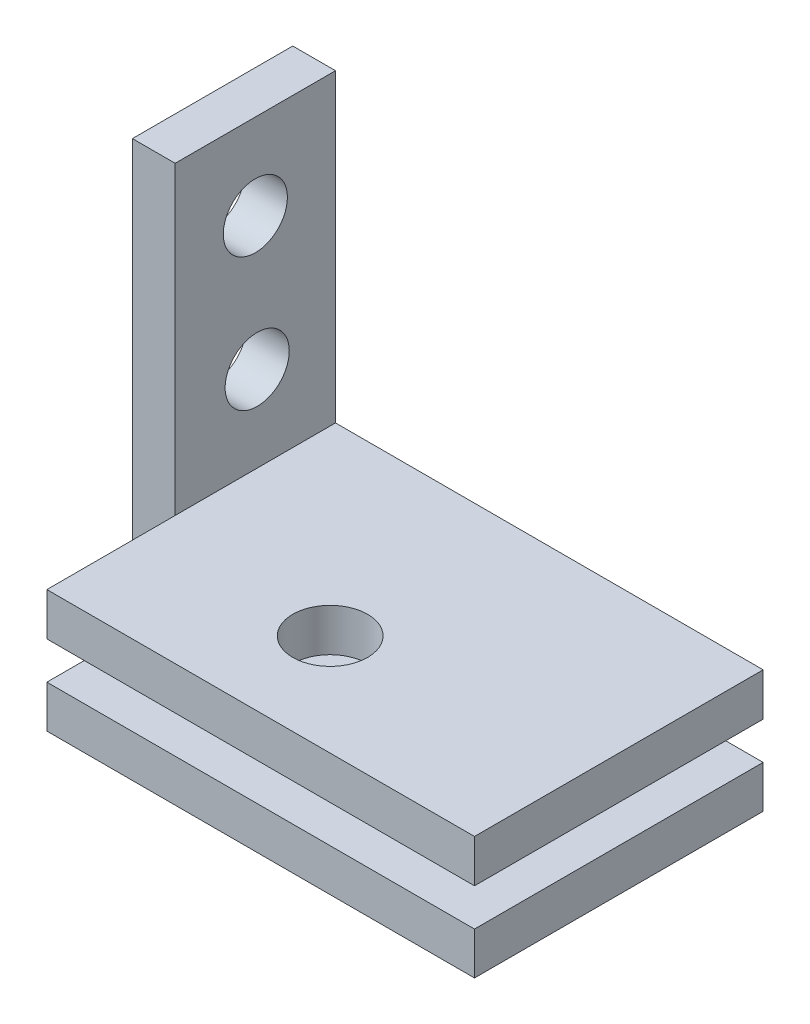
ISO-10303-21;
HEADER;
FILE_DESCRIPTION(('STEP AP214'),'2;1');
FILE_NAME('part.step','',(''),(''),'','','');
FILE_SCHEMA(('AUTOMOTIVE_DESIGN { 1 0 10303 214 1 1 1 1 }'));
ENDSEC;
DATA;
#1=APPLICATION_CONTEXT('core data for automotive mechanical design processes');
#2=APPLICATION_PROTOCOL_DEFINITION('international standard','automotive_design',2000,#1);
#3=PRODUCT_CONTEXT('',#1,'mechanical');
#4=PRODUCT('Part','Part','',(#3));
#5=PRODUCT_RELATED_PRODUCT_CATEGORY('part','',(#4));
#6=PRODUCT_DEFINITION_FORMATION('','',#4);
#7=PRODUCT_DEFINITION_CONTEXT('part definition',#1,'design');
#8=PRODUCT_DEFINITION('design','',#6,#7);
#9=PRODUCT_DEFINITION_SHAPE('','',#8);
#10=(LENGTH_UNIT() NAMED_UNIT(*) SI_UNIT(.MILLI.,.METRE.));
#11=(NAMED_UNIT(*) PLANE_ANGLE_UNIT() SI_UNIT($,.RADIAN.));
#12=(NAMED_UNIT(*) SI_UNIT($,.STERADIAN.) SOLID_ANGLE_UNIT());
#13=UNCERTAINTY_MEASURE_WITH_UNIT(LENGTH_MEASURE(1.E-05),#10,'distance_accuracy_value','');
#14=(GEOMETRIC_REPRESENTATION_CONTEXT(3) GLOBAL_UNCERTAINTY_ASSIGNED_CONTEXT((#13)) GLOBAL_UNIT_ASSIGNED_CONTEXT((#10,
#11,#12)) REPRESENTATION_CONTEXT('',''));
#15=CARTESIAN_POINT('',(0.,0.,0.));
#16=DIRECTION('',(0.,0.,1.));
#17=DIRECTION('',(1.,0.,0.));
#18=AXIS2_PLACEMENT_3D('',#15,#16,#17);
#19=CARTESIAN_POINT('',(2.,9.02439024390244,0.740418118466899));
#20=DIRECTION('',(0.,0.,-1.));
#21=DIRECTION('',(0.,1.,0.));
#22=AXIS2_PLACEMENT_3D('',#19,#20,#21);
#23=PLANE('',#22);
#24=DIRECTION('',(0.,-1.,0.));
#25=VECTOR('',#24,1.);
#26=CARTESIAN_POINT('',(2.,-8.99213043612717,0.740418118466898));
#27=LINE('',#26,#25);
#28=CARTESIAN_POINT('',(2.,-8.99213043612717,0.740418118466898));
#29=VERTEX_POINT('',#28);
#30=CARTESIAN_POINT('',(2.,-10.9756097560976,0.740418118466898));
#31=VERTEX_POINT('',#30);
#32=EDGE_CURVE('E161',#29,#31,#27,.T.);
#33=ORIENTED_EDGE('',*,*,#32,.F.);
#34=DIRECTION('',(0.,-1.,0.));
#35=VECTOR('',#34,1.);
#36=CARTESIAN_POINT('',(2.,9.02439024390244,0.740418118466899));
#37=LINE('',#36,#35);
#38=CARTESIAN_POINT('',(2.,-7.24213043612717,0.740418118466898));
#39=VERTEX_POINT('',#38);
#40=EDGE_CURVE('E255',#39,#29,#37,.T.);
#41=ORIENTED_EDGE('',*,*,#40,.F.);
#42=DIRECTION('',(0.,-1.,0.));
#43=VECTOR('',#42,1.);
#44=CARTESIAN_POINT('',(2.,-5.24213043612717,0.740418118466898));
#45=LINE('',#44,#43);
#46=CARTESIAN_POINT('',(2.,-5.24213043612717,0.740418118466897));
#47=VERTEX_POINT('',#46);
#48=EDGE_CURVE('E62',#47,#39,#45,.T.);
#49=ORIENTED_EDGE('',*,*,#48,.F.);
#50=CARTESIAN_POINT('',(2.,9.02439024390244,0.740418118466899));
#51=VERTEX_POINT('',#50);
#52=EDGE_CURVE('E251',#51,#47,#37,.T.);
#53=ORIENTED_EDGE('',*,*,#52,.F.);
#54=DIRECTION('',(-1.,0.,0.));
#55=VECTOR('',#54,1.);
#56=CARTESIAN_POINT('',(2.,9.02439024390244,0.740418118466899));
#57=LINE('',#56,#55);
#58=CARTESIAN_POINT('',(0.,9.02439024390244,0.740418118466899));
#59=VERTEX_POINT('',#58);
#60=EDGE_CURVE('E261',#51,#59,#57,.T.);
#61=ORIENTED_EDGE('',*,*,#60,.T.);
#62=DIRECTION('',(0.,-1.,0.));
#63=VECTOR('',#62,1.);
#64=CARTESIAN_POINT('',(0.,9.02439024390244,0.740418118466899));
#65=LINE('',#64,#63);
#66=CARTESIAN_POINT('',(0.,-10.9756097560976,0.740418118466897));
#67=VERTEX_POINT('',#66);
#68=EDGE_CURVE('E250',#59,#67,#65,.T.);
#69=ORIENTED_EDGE('',*,*,#68,.T.);
#70=DIRECTION('',(-1.,0.,0.));
#71=VECTOR('',#70,1.);
#72=CARTESIAN_POINT('',(2.,-10.9756097560976,0.740418118466897));
#73=LINE('',#72,#71);
#74=EDGE_CURVE('E11',#31,#67,#73,.T.);
#75=ORIENTED_EDGE('',*,*,#74,.F.);
#76=EDGE_LOOP('',(#33,#41,#49,#53,#61,#69,#75));
#77=FACE_BOUND('',#76,.T.);
#78=ADVANCED_FACE('F45',(#77),#23,.F.);
#79=CARTESIAN_POINT('',(2.,0.,0.));
#80=DIRECTION('',(1.,0.,0.));
#81=DIRECTION('',(0.,0.,-1.));
#82=AXIS2_PLACEMENT_3D('',#79,#80,#81);
#83=PLANE('',#82);
#84=DIRECTION('',(0.,1.,0.));
#85=VECTOR('',#84,1.);
#86=CARTESIAN_POINT('',(2.,9.02439024390244,-6.7595818815331));
#87=LINE('',#86,#85);
#88=CARTESIAN_POINT('',(2.,-8.99213043612717,-6.7595818815331));
#89=VERTEX_POINT('',#88);
#90=CARTESIAN_POINT('',(2.,-7.24213043612718,-6.7595818815331));
#91=VERTEX_POINT('',#90);
#92=EDGE_CURVE('E70',#89,#91,#87,.T.);
#93=ORIENTED_EDGE('',*,*,#92,.T.);
#94=DIRECTION('',(0.,0.,-1.));
#95=VECTOR('',#94,1.);
#96=CARTESIAN_POINT('',(2.,-7.24213043612717,0.));
#97=LINE('',#96,#95);
#98=EDGE_CURVE('E212',#39,#91,#97,.T.);
#99=ORIENTED_EDGE('',*,*,#98,.F.);
#100=ORIENTED_EDGE('',*,*,#40,.T.);
#101=DIRECTION('',(0.,0.,1.));
#102=VECTOR('',#101,1.);
#103=CARTESIAN_POINT('',(2.,-8.99213043612717,-6.7595818815331));
#104=LINE('',#103,#102);
#105=EDGE_CURVE('E233',#89,#29,#104,.T.);
#106=ORIENTED_EDGE('',*,*,#105,.F.);
#107=EDGE_LOOP('',(#93,#99,#100,#106));
#108=FACE_BOUND('',#107,.T.);
#109=ADVANCED_FACE('F310',(#108),#83,.T.);
#110=CARTESIAN_POINT('',(2.,-10.9756097560976,0.740418118466897));
#111=DIRECTION('',(0.,1.,0.));
#112=DIRECTION('',(0.,0.,1.));
#113=AXIS2_PLACEMENT_3D('',#110,#111,#112);
#114=PLANE('',#113);
#115=CARTESIAN_POINT('',(10.5,-10.9756097560976,1.9904181184669));
#116=DIRECTION('',(0.,1.,0.));
#117=DIRECTION('',(0.,0.,1.));
#118=AXIS2_PLACEMENT_3D('',#115,#116,#117);
#119=CIRCLE('',#118,1.75);
#120=CARTESIAN_POINT('',(10.5,-10.9756097560976,3.7404181184669));
#121=VERTEX_POINT('',#120);
#122=EDGE_CURVE('E318',#121,#121,#119,.T.);
#123=ORIENTED_EDGE('',*,*,#122,.T.);
#124=EDGE_LOOP('',(#123));
#125=FACE_BOUND('',#124,.T.);
#126=DIRECTION('',(0.,0.,-1.));
#127=VECTOR('',#126,1.);
#128=CARTESIAN_POINT('',(0.,-10.9756097560976,0.740418118466897));
#129=LINE('',#128,#127);
#130=CARTESIAN_POINT('',(0.,-10.9756097560976,-6.7595818815331));
#131=VERTEX_POINT('',#130);
#132=EDGE_CURVE('E265',#67,#131,#129,.T.);
#133=ORIENTED_EDGE('',*,*,#132,.T.);
#134=DIRECTION('',(-1.,0.,0.));
#135=VECTOR('',#134,1.);
#136=CARTESIAN_POINT('',(2.,-10.9756097560976,-6.7595818815331));
#137=LINE('',#136,#135);
#138=CARTESIAN_POINT('',(22.,-10.9756097560976,-6.7595818815331));
#139=VERTEX_POINT('',#138);
#140=EDGE_CURVE('E54',#139,#131,#137,.T.);
#141=ORIENTED_EDGE('',*,*,#140,.F.);
#142=DIRECTION('',(0.,0.,-1.));
#143=VECTOR('',#142,1.);
#144=CARTESIAN_POINT('',(22.,-10.9756097560976,-6.7595818815331));
#145=LINE('',#144,#143);
#146=CARTESIAN_POINT('',(22.,-10.9756097560976,6.7404181184669));
#147=VERTEX_POINT('',#146);
#148=EDGE_CURVE('E146',#147,#139,#145,.T.);
#149=ORIENTED_EDGE('',*,*,#148,.F.);
#150=DIRECTION('',(1.,0.,0.));
#151=VECTOR('',#150,1.);
#152=CARTESIAN_POINT('',(2.,-10.9756097560976,6.7404181184669));
#153=LINE('',#152,#151);
#154=CARTESIAN_POINT('',(2.,-10.9756097560976,6.7404181184669));
#155=VERTEX_POINT('',#154);
#156=EDGE_CURVE('E139',#155,#147,#153,.T.);
#157=ORIENTED_EDGE('',*,*,#156,.F.);
#158=DIRECTION('',(0.,0.,-1.));
#159=VECTOR('',#158,1.);
#160=CARTESIAN_POINT('',(2.,-10.9756097560976,6.7404181184669));
#161=LINE('',#160,#159);
#162=EDGE_CURVE('E143',#155,#31,#161,.T.);
#163=ORIENTED_EDGE('',*,*,#162,.T.);
#164=ORIENTED_EDGE('',*,*,#74,.T.);
#165=EDGE_LOOP('',(#133,#141,#149,#157,#163,#164));
#166=FACE_BOUND('',#165,.T.);
#167=ADVANCED_FACE('F141',(#125,#166),#114,.F.);
#168=CARTESIAN_POINT('',(2.,9.02439024390244,-6.7595818815331));
#169=DIRECTION('',(0.,0.,1.));
#170=DIRECTION('',(1.,0.,0.));
#171=AXIS2_PLACEMENT_3D('',#168,#169,#170);
#172=PLANE('',#171);
#173=DIRECTION('',(0.,1.,0.));
#174=VECTOR('',#173,1.);
#175=CARTESIAN_POINT('',(0.,9.02439024390244,-6.7595818815331));
#176=LINE('',#175,#174);
#177=CARTESIAN_POINT('',(0.,9.02439024390244,-6.7595818815331));
#178=VERTEX_POINT('',#177);
#179=EDGE_CURVE('E268',#131,#178,#176,.T.);
#180=ORIENTED_EDGE('',*,*,#179,.T.);
#181=DIRECTION('',(-1.,0.,0.));
#182=VECTOR('',#181,1.);
#183=CARTESIAN_POINT('',(2.,9.02439024390244,-6.7595818815331));
#184=LINE('',#183,#182);
#185=CARTESIAN_POINT('',(2.,9.02439024390244,-6.7595818815331));
#186=VERTEX_POINT('',#185);
#187=EDGE_CURVE('E277',#186,#178,#184,.T.);
#188=ORIENTED_EDGE('',*,*,#187,.F.);
#189=CARTESIAN_POINT('',(2.,-5.24213043612717,-6.7595818815331));
#190=VERTEX_POINT('',#189);
#191=EDGE_CURVE('E254',#190,#186,#87,.T.);
#192=ORIENTED_EDGE('',*,*,#191,.F.);
#193=DIRECTION('',(-1.,0.,0.));
#194=VECTOR('',#193,1.);
#195=CARTESIAN_POINT('',(22.,-5.24213043612717,-6.7595818815331));
#196=LINE('',#195,#194);
#197=CARTESIAN_POINT('',(22.,-5.24213043612717,-6.7595818815331));
#198=VERTEX_POINT('',#197);
#199=EDGE_CURVE('E218',#198,#190,#196,.T.);
#200=ORIENTED_EDGE('',*,*,#199,.F.);
#201=DIRECTION('',(0.,1.,0.));
#202=VECTOR('',#201,1.);
#203=CARTESIAN_POINT('',(22.,0.,-6.7595818815331));
#204=LINE('',#203,#202);
#205=CARTESIAN_POINT('',(22.,-7.24213043612717,-6.7595818815331));
#206=VERTEX_POINT('',#205);
#207=EDGE_CURVE('E215',#206,#198,#204,.T.);
#208=ORIENTED_EDGE('',*,*,#207,.F.);
#209=DIRECTION('',(-1.,0.,0.));
#210=VECTOR('',#209,1.);
#211=CARTESIAN_POINT('',(22.,-7.24213043612717,-6.7595818815331));
#212=LINE('',#211,#210);
#213=EDGE_CURVE('E229',#206,#91,#212,.T.);
#214=ORIENTED_EDGE('',*,*,#213,.T.);
#215=ORIENTED_EDGE('',*,*,#92,.F.);
#216=DIRECTION('',(-1.,0.,0.));
#217=VECTOR('',#216,1.);
#218=CARTESIAN_POINT('',(22.,-8.99213043612717,-6.7595818815331));
#219=LINE('',#218,#217);
#220=CARTESIAN_POINT('',(22.,-8.99213043612717,-6.7595818815331));
#221=VERTEX_POINT('',#220);
#222=EDGE_CURVE('E243',#221,#89,#219,.T.);
#223=ORIENTED_EDGE('',*,*,#222,.F.);
#224=DIRECTION('',(0.,1.,0.));
#225=VECTOR('',#224,1.);
#226=CARTESIAN_POINT('',(22.,-10.9756097560976,-6.7595818815331));
#227=LINE('',#226,#225);
#228=EDGE_CURVE('E234',#139,#221,#227,.T.);
#229=ORIENTED_EDGE('',*,*,#228,.F.);
#230=ORIENTED_EDGE('',*,*,#140,.T.);
#231=EDGE_LOOP('',(#180,#188,#192,#200,#208,#214,#215,#223,#229,#230));
#232=FACE_BOUND('',#231,.T.);
#233=ADVANCED_FACE('F325',(#232),#172,.F.);
#234=CARTESIAN_POINT('',(2.,9.02439024390244,0.740418118466899));
#235=DIRECTION('',(0.,-1.,0.));
#236=DIRECTION('',(0.,0.,-1.));
#237=AXIS2_PLACEMENT_3D('',#234,#235,#236);
#238=PLANE('',#237);
#239=DIRECTION('',(0.,0.,1.));
#240=VECTOR('',#239,1.);
#241=CARTESIAN_POINT('',(0.,9.02439024390244,0.740418118466899));
#242=LINE('',#241,#240);
#243=EDGE_CURVE('E271',#178,#59,#242,.T.);
#244=ORIENTED_EDGE('',*,*,#243,.T.);
#245=ORIENTED_EDGE('',*,*,#60,.F.);
#246=DIRECTION('',(0.,0.,1.));
#247=VECTOR('',#246,1.);
#248=CARTESIAN_POINT('',(2.,9.02439024390244,0.740418118466899));
#249=LINE('',#248,#247);
#250=EDGE_CURVE('E258',#186,#51,#249,.T.);
#251=ORIENTED_EDGE('',*,*,#250,.F.);
#252=ORIENTED_EDGE('',*,*,#187,.T.);
#253=EDGE_LOOP('',(#244,#245,#251,#252));
#254=FACE_BOUND('',#253,.T.);
#255=ADVANCED_FACE('F348',(#254),#238,.F.);
#256=CARTESIAN_POINT('',(2.,5.02439024390244,-3.0095818815331));
#257=DIRECTION('',(1.,0.,0.));
#258=DIRECTION('',(0.,0.,-1.));
#259=AXIS2_PLACEMENT_3D('',#256,#257,#258);
#260=CIRCLE('',#259,1.5);
#261=CARTESIAN_POINT('',(2.,5.02439024390244,-4.5095818815331));
#262=VERTEX_POINT('',#261);
#263=EDGE_CURVE('E199',#262,#262,#260,.T.);
#264=ORIENTED_EDGE('',*,*,#263,.F.);
#265=EDGE_LOOP('',(#264));
#266=FACE_BOUND('',#265,.T.);
#267=CARTESIAN_POINT('',(2.,-1.24213043612717,-3.09645831879379));
#268=DIRECTION('',(1.,0.,0.));
#269=DIRECTION('',(0.,0.,-1.));
#270=AXIS2_PLACEMENT_3D('',#267,#268,#269);
#271=CIRCLE('',#270,1.5);
#272=CARTESIAN_POINT('',(2.,-1.24213043612717,-4.59645831879379));
#273=VERTEX_POINT('',#272);
#274=EDGE_CURVE('E198',#273,#273,#271,.T.);
#275=ORIENTED_EDGE('',*,*,#274,.F.);
#276=EDGE_LOOP('',(#275));
#277=FACE_BOUND('',#276,.T.);
#278=DIRECTION('',(0.,0.,-1.));
#279=VECTOR('',#278,1.);
#280=CARTESIAN_POINT('',(2.,-5.24213043612717,0.));
#281=LINE('',#280,#279);
#282=EDGE_CURVE('E219',#47,#190,#281,.T.);
#283=ORIENTED_EDGE('',*,*,#282,.T.);
#284=ORIENTED_EDGE('',*,*,#191,.T.);
#285=ORIENTED_EDGE('',*,*,#250,.T.);
#286=ORIENTED_EDGE('',*,*,#52,.T.);
#287=EDGE_LOOP('',(#283,#284,#285,#286));
#288=FACE_BOUND('',#287,.T.);
#289=ADVANCED_FACE('F315',(#266,#277,#288),#83,.T.);
#290=CARTESIAN_POINT('',(0.,0.,0.));
#291=DIRECTION('',(1.,0.,0.));
#292=DIRECTION('',(0.,0.,-1.));
#293=AXIS2_PLACEMENT_3D('',#290,#291,#292);
#294=PLANE('',#293);
#295=CARTESIAN_POINT('',(0.,5.02439024390244,-3.0095818815331));
#296=DIRECTION('',(1.,0.,0.));
#297=DIRECTION('',(0.,0.,-1.));
#298=AXIS2_PLACEMENT_3D('',#295,#296,#297);
#299=CIRCLE('',#298,1.5);
#300=CARTESIAN_POINT('',(0.,5.02439024390244,-4.5095818815331));
#301=VERTEX_POINT('',#300);
#302=EDGE_CURVE('E223',#301,#301,#299,.T.);
#303=ORIENTED_EDGE('',*,*,#302,.T.);
#304=EDGE_LOOP('',(#303));
#305=FACE_BOUND('',#304,.T.);
#306=CARTESIAN_POINT('',(0.,-1.24213043612717,-3.09645831879379));
#307=DIRECTION('',(1.,0.,0.));
#308=DIRECTION('',(0.,0.,-1.));
#309=AXIS2_PLACEMENT_3D('',#306,#307,#308);
#310=CIRCLE('',#309,1.5);
#311=CARTESIAN_POINT('',(0.,-1.24213043612717,-4.59645831879379));
#312=VERTEX_POINT('',#311);
#313=EDGE_CURVE('E203',#312,#312,#310,.T.);
#314=ORIENTED_EDGE('',*,*,#313,.T.);
#315=EDGE_LOOP('',(#314));
#316=FACE_BOUND('',#315,.T.);
#317=ORIENTED_EDGE('',*,*,#68,.F.);
#318=ORIENTED_EDGE('',*,*,#243,.F.);
#319=ORIENTED_EDGE('',*,*,#179,.F.);
#320=ORIENTED_EDGE('',*,*,#132,.F.);
#321=EDGE_LOOP('',(#317,#318,#319,#320));
#322=FACE_BOUND('',#321,.T.);
#323=ADVANCED_FACE('F290',(#305,#316,#322),#294,.F.);
#324=CARTESIAN_POINT('',(22.,-8.99213043612717,-6.7595818815331));
#325=DIRECTION('',(0.,-1.,0.));
#326=DIRECTION('',(0.,0.,-1.));
#327=AXIS2_PLACEMENT_3D('',#324,#325,#326);
#328=PLANE('',#327);
#329=CARTESIAN_POINT('',(10.5,-8.99213043612717,1.9904181184669));
#330=DIRECTION('',(0.,-1.,0.));
#331=DIRECTION('',(0.,0.,-1.));
#332=AXIS2_PLACEMENT_3D('',#329,#330,#331);
#333=CIRCLE('',#332,1.75);
#334=CARTESIAN_POINT('',(10.5,-8.99213043612717,0.240418118466898));
#335=VERTEX_POINT('',#334);
#336=EDGE_CURVE('E366',#335,#335,#333,.T.);
#337=ORIENTED_EDGE('',*,*,#336,.T.);
#338=EDGE_LOOP('',(#337));
#339=FACE_BOUND('',#338,.T.);
#340=ORIENTED_EDGE('',*,*,#105,.T.);
#341=DIRECTION('',(0.,0.,-1.));
#342=VECTOR('',#341,1.);
#343=CARTESIAN_POINT('',(2.,-8.99213043612717,6.7404181184669));
#344=LINE('',#343,#342);
#345=CARTESIAN_POINT('',(2.,-8.99213043612717,6.7404181184669));
#346=VERTEX_POINT('',#345);
#347=EDGE_CURVE('E167',#346,#29,#344,.T.);
#348=ORIENTED_EDGE('',*,*,#347,.F.);
#349=DIRECTION('',(-1.,0.,0.));
#350=VECTOR('',#349,1.);
#351=CARTESIAN_POINT('',(2.,-8.99213043612717,6.7404181184669));
#352=LINE('',#351,#350);
#353=CARTESIAN_POINT('',(22.,-8.99213043612717,6.7404181184669));
#354=VERTEX_POINT('',#353);
#355=EDGE_CURVE('E157',#354,#346,#352,.T.);
#356=ORIENTED_EDGE('',*,*,#355,.F.);
#357=DIRECTION('',(0.,0.,1.));
#358=VECTOR('',#357,1.);
#359=CARTESIAN_POINT('',(22.,-8.99213043612717,-6.7595818815331));
#360=LINE('',#359,#358);
#361=EDGE_CURVE('E238',#221,#354,#360,.T.);
#362=ORIENTED_EDGE('',*,*,#361,.F.);
#363=ORIENTED_EDGE('',*,*,#222,.T.);
#364=EDGE_LOOP('',(#340,#348,#356,#362,#363));
#365=FACE_BOUND('',#364,.T.);
#366=ADVANCED_FACE('F321',(#339,#365),#328,.F.);
#367=CARTESIAN_POINT('',(22.,0.,0.));
#368=DIRECTION('',(1.,0.,0.));
#369=DIRECTION('',(0.,0.,-1.));
#370=AXIS2_PLACEMENT_3D('',#367,#368,#369);
#371=PLANE('',#370);
#372=ORIENTED_EDGE('',*,*,#228,.T.);
#373=ORIENTED_EDGE('',*,*,#361,.T.);
#374=DIRECTION('',(0.,1.,0.));
#375=VECTOR('',#374,1.);
#376=CARTESIAN_POINT('',(22.,-8.99213043612717,6.7404181184669));
#377=LINE('',#376,#375);
#378=EDGE_CURVE('E151',#147,#354,#377,.T.);
#379=ORIENTED_EDGE('',*,*,#378,.F.);
#380=ORIENTED_EDGE('',*,*,#148,.T.);
#381=EDGE_LOOP('',(#372,#373,#379,#380));
#382=FACE_BOUND('',#381,.T.);
#383=ADVANCED_FACE('F377',(#382),#371,.T.);
#384=CARTESIAN_POINT('',(22.,-5.24213043612717,0.));
#385=DIRECTION('',(0.,1.,0.));
#386=DIRECTION('',(0.,0.,1.));
#387=AXIS2_PLACEMENT_3D('',#384,#385,#386);
#388=PLANE('',#387);
#389=CARTESIAN_POINT('',(10.5,-5.24213043612717,1.9904181184669));
#390=DIRECTION('',(0.,1.,0.));
#391=DIRECTION('',(0.,0.,1.));
#392=AXIS2_PLACEMENT_3D('',#389,#390,#391);
#393=CIRCLE('',#392,1.75);
#394=CARTESIAN_POINT('',(10.5,-5.24213043612717,3.7404181184669));
#395=VERTEX_POINT('',#394);
#396=EDGE_CURVE('E421',#395,#395,#393,.T.);
#397=ORIENTED_EDGE('',*,*,#396,.F.);
#398=EDGE_LOOP('',(#397));
#399=FACE_BOUND('',#398,.T.);
#400=ORIENTED_EDGE('',*,*,#282,.F.);
#401=DIRECTION('',(0.,0.,-1.));
#402=VECTOR('',#401,1.);
#403=CARTESIAN_POINT('',(2.,-5.24213043612717,6.7404181184669));
#404=LINE('',#403,#402);
#405=CARTESIAN_POINT('',(2.,-5.24213043612717,6.7404181184669));
#406=VERTEX_POINT('',#405);
#407=EDGE_CURVE('E189',#406,#47,#404,.T.);
#408=ORIENTED_EDGE('',*,*,#407,.F.);
#409=DIRECTION('',(-1.,0.,0.));
#410=VECTOR('',#409,1.);
#411=CARTESIAN_POINT('',(2.,-5.24213043612717,6.7404181184669));
#412=LINE('',#411,#410);
#413=CARTESIAN_POINT('',(22.,-5.24213043612717,6.7404181184669));
#414=VERTEX_POINT('',#413);
#415=EDGE_CURVE('E187',#414,#406,#412,.T.);
#416=ORIENTED_EDGE('',*,*,#415,.F.);
#417=DIRECTION('',(0.,0.,-1.));
#418=VECTOR('',#417,1.);
#419=CARTESIAN_POINT('',(22.,-5.24213043612717,0.));
#420=LINE('',#419,#418);
#421=EDGE_CURVE('E207',#414,#198,#420,.T.);
#422=ORIENTED_EDGE('',*,*,#421,.T.);
#423=ORIENTED_EDGE('',*,*,#199,.T.);
#424=EDGE_LOOP('',(#400,#408,#416,#422,#423));
#425=FACE_BOUND('',#424,.T.);
#426=ADVANCED_FACE('F337',(#399,#425),#388,.T.);
#427=CARTESIAN_POINT('',(22.,-7.24213043612717,0.));
#428=DIRECTION('',(0.,1.,0.));
#429=DIRECTION('',(0.,0.,1.));
#430=AXIS2_PLACEMENT_3D('',#427,#428,#429);
#431=PLANE('',#430);
#432=CARTESIAN_POINT('',(10.5,-7.24213043612717,1.9904181184669));
#433=DIRECTION('',(0.,1.,0.));
#434=DIRECTION('',(0.,0.,1.));
#435=AXIS2_PLACEMENT_3D('',#432,#433,#434);
#436=CIRCLE('',#435,1.75);
#437=CARTESIAN_POINT('',(10.5,-7.24213043612717,3.7404181184669));
#438=VERTEX_POINT('',#437);
#439=EDGE_CURVE('E48',#438,#438,#436,.T.);
#440=ORIENTED_EDGE('',*,*,#439,.T.);
#441=EDGE_LOOP('',(#440));
#442=FACE_BOUND('',#441,.T.);
#443=ORIENTED_EDGE('',*,*,#98,.T.);
#444=ORIENTED_EDGE('',*,*,#213,.F.);
#445=DIRECTION('',(0.,0.,-1.));
#446=VECTOR('',#445,1.);
#447=CARTESIAN_POINT('',(22.,-7.24213043612717,0.));
#448=LINE('',#447,#446);
#449=CARTESIAN_POINT('',(22.,-7.24213043612717,6.7404181184669));
#450=VERTEX_POINT('',#449);
#451=EDGE_CURVE('E211',#450,#206,#448,.T.);
#452=ORIENTED_EDGE('',*,*,#451,.F.);
#453=DIRECTION('',(1.,0.,0.));
#454=VECTOR('',#453,1.);
#455=CARTESIAN_POINT('',(2.,-7.24213043612717,6.7404181184669));
#456=LINE('',#455,#454);
#457=CARTESIAN_POINT('',(2.,-7.24213043612717,6.7404181184669));
#458=VERTEX_POINT('',#457);
#459=EDGE_CURVE('E179',#458,#450,#456,.T.);
#460=ORIENTED_EDGE('',*,*,#459,.F.);
#461=DIRECTION('',(0.,0.,-1.));
#462=VECTOR('',#461,1.);
#463=CARTESIAN_POINT('',(2.,-7.24213043612717,6.7404181184669));
#464=LINE('',#463,#462);
#465=EDGE_CURVE('E194',#458,#39,#464,.T.);
#466=ORIENTED_EDGE('',*,*,#465,.T.);
#467=EDGE_LOOP('',(#443,#444,#452,#460,#466));
#468=FACE_BOUND('',#467,.T.);
#469=ADVANCED_FACE('F330',(#442,#468),#431,.F.);
#470=CARTESIAN_POINT('',(22.,0.,0.));
#471=DIRECTION('',(1.,0.,0.));
#472=DIRECTION('',(0.,0.,-1.));
#473=AXIS2_PLACEMENT_3D('',#470,#471,#472);
#474=PLANE('',#473);
#475=ORIENTED_EDGE('',*,*,#421,.F.);
#476=DIRECTION('',(0.,1.,0.));
#477=VECTOR('',#476,1.);
#478=CARTESIAN_POINT('',(22.,-5.24213043612717,6.7404181184669));
#479=LINE('',#478,#477);
#480=EDGE_CURVE('E183',#450,#414,#479,.T.);
#481=ORIENTED_EDGE('',*,*,#480,.F.);
#482=ORIENTED_EDGE('',*,*,#451,.T.);
#483=ORIENTED_EDGE('',*,*,#207,.T.);
#484=EDGE_LOOP('',(#475,#481,#482,#483));
#485=FACE_BOUND('',#484,.T.);
#486=ADVANCED_FACE('F306',(#485),#474,.T.);
#487=CARTESIAN_POINT('',(-18.,-1.24213043612717,-3.09645831879379));
#488=DIRECTION('',(1.,0.,0.));
#489=DIRECTION('',(0.,0.,-1.));
#490=AXIS2_PLACEMENT_3D('',#487,#488,#489);
#491=CYLINDRICAL_SURFACE('',#490,1.5);
#492=ORIENTED_EDGE('',*,*,#274,.T.);
#493=EDGE_LOOP('',(#492));
#494=FACE_BOUND('',#493,.T.);
#495=ORIENTED_EDGE('',*,*,#313,.F.);
#496=EDGE_LOOP('',(#495));
#497=FACE_BOUND('',#496,.T.);
#498=ADVANCED_FACE('F296',(#494,#497),#491,.F.);
#499=CARTESIAN_POINT('',(-18.,5.02439024390244,-3.0095818815331));
#500=DIRECTION('',(1.,0.,0.));
#501=DIRECTION('',(0.,0.,-1.));
#502=AXIS2_PLACEMENT_3D('',#499,#500,#501);
#503=CYLINDRICAL_SURFACE('',#502,1.5);
#504=ORIENTED_EDGE('',*,*,#263,.T.);
#505=EDGE_LOOP('',(#504));
#506=FACE_BOUND('',#505,.T.);
#507=ORIENTED_EDGE('',*,*,#302,.F.);
#508=EDGE_LOOP('',(#507));
#509=FACE_BOUND('',#508,.T.);
#510=ADVANCED_FACE('F293',(#506,#509),#503,.F.);
#511=CARTESIAN_POINT('',(2.,-5.24213043612717,6.7404181184669));
#512=DIRECTION('',(1.,0.,0.));
#513=DIRECTION('',(0.,0.,-1.));
#514=AXIS2_PLACEMENT_3D('',#511,#512,#513);
#515=PLANE('',#514);
#516=ORIENTED_EDGE('',*,*,#48,.T.);
#517=ORIENTED_EDGE('',*,*,#465,.F.);
#518=DIRECTION('',(0.,-1.,0.));
#519=VECTOR('',#518,1.);
#520=CARTESIAN_POINT('',(2.,-5.24213043612717,6.7404181184669));
#521=LINE('',#520,#519);
#522=EDGE_CURVE('E171',#406,#458,#521,.T.);
#523=ORIENTED_EDGE('',*,*,#522,.F.);
#524=ORIENTED_EDGE('',*,*,#407,.T.);
#525=EDGE_LOOP('',(#516,#517,#523,#524));
#526=FACE_BOUND('',#525,.T.);
#527=ADVANCED_FACE('F295',(#526),#515,.F.);
#528=CARTESIAN_POINT('',(0.,0.,6.7404181184669));
#529=DIRECTION('',(0.,0.,1.));
#530=DIRECTION('',(1.,0.,0.));
#531=AXIS2_PLACEMENT_3D('',#528,#529,#530);
#532=PLANE('',#531);
#533=ORIENTED_EDGE('',*,*,#522,.T.);
#534=ORIENTED_EDGE('',*,*,#459,.T.);
#535=ORIENTED_EDGE('',*,*,#480,.T.);
#536=ORIENTED_EDGE('',*,*,#415,.T.);
#537=EDGE_LOOP('',(#533,#534,#535,#536));
#538=FACE_BOUND('',#537,.T.);
#539=ADVANCED_FACE('F303',(#538),#532,.T.);
#540=CARTESIAN_POINT('',(2.,-8.99213043612717,6.7404181184669));
#541=DIRECTION('',(1.,0.,0.));
#542=DIRECTION('',(0.,0.,-1.));
#543=AXIS2_PLACEMENT_3D('',#540,#541,#542);
#544=PLANE('',#543);
#545=ORIENTED_EDGE('',*,*,#32,.T.);
#546=ORIENTED_EDGE('',*,*,#162,.F.);
#547=DIRECTION('',(0.,-1.,0.));
#548=VECTOR('',#547,1.);
#549=CARTESIAN_POINT('',(2.,-8.99213043612717,6.7404181184669));
#550=LINE('',#549,#548);
#551=EDGE_CURVE('E152',#346,#155,#550,.T.);
#552=ORIENTED_EDGE('',*,*,#551,.F.);
#553=ORIENTED_EDGE('',*,*,#347,.T.);
#554=EDGE_LOOP('',(#545,#546,#552,#553));
#555=FACE_BOUND('',#554,.T.);
#556=ADVANCED_FACE('F163',(#555),#544,.F.);
#557=CARTESIAN_POINT('',(0.,0.,6.7404181184669));
#558=DIRECTION('',(0.,0.,1.));
#559=DIRECTION('',(1.,0.,0.));
#560=AXIS2_PLACEMENT_3D('',#557,#558,#559);
#561=PLANE('',#560);
#562=ORIENTED_EDGE('',*,*,#551,.T.);
#563=ORIENTED_EDGE('',*,*,#156,.T.);
#564=ORIENTED_EDGE('',*,*,#378,.T.);
#565=ORIENTED_EDGE('',*,*,#355,.T.);
#566=EDGE_LOOP('',(#562,#563,#564,#565));
#567=FACE_BOUND('',#566,.T.);
#568=ADVANCED_FACE('F155',(#567),#561,.T.);
#569=CARTESIAN_POINT('',(10.5,-11.2421304361272,1.9904181184669));
#570=DIRECTION('',(0.,1.,0.));
#571=DIRECTION('',(0.,0.,1.));
#572=AXIS2_PLACEMENT_3D('',#569,#570,#571);
#573=CYLINDRICAL_SURFACE('',#572,1.75);
#574=ORIENTED_EDGE('',*,*,#396,.T.);
#575=EDGE_LOOP('',(#574));
#576=FACE_BOUND('',#575,.T.);
#577=ORIENTED_EDGE('',*,*,#439,.F.);
#578=EDGE_LOOP('',(#577));
#579=FACE_BOUND('',#578,.T.);
#580=ADVANCED_FACE('F407',(#576,#579),#573,.F.);
#581=ORIENTED_EDGE('',*,*,#336,.F.);
#582=EDGE_LOOP('',(#581));
#583=FACE_BOUND('',#582,.T.);
#584=ORIENTED_EDGE('',*,*,#122,.F.);
#585=EDGE_LOOP('',(#584));
#586=FACE_BOUND('',#585,.T.);
#587=ADVANCED_FACE('F408',(#583,#586),#573,.F.);
#588=CLOSED_SHELL('',(#78,#109,#167,#233,#255,#289,#323,#366,#383,#426,#469,#486,#498,#510,#527,
#539,#556,#568,#580,#587));
#589=MANIFOLD_SOLID_BREP('B2',#588);
#590=ADVANCED_BREP_SHAPE_REPRESENTATION('',(#18,#589),#14);
#591=SHAPE_DEFINITION_REPRESENTATION(#9,#590);
ENDSEC;
END-ISO-10303-21;
